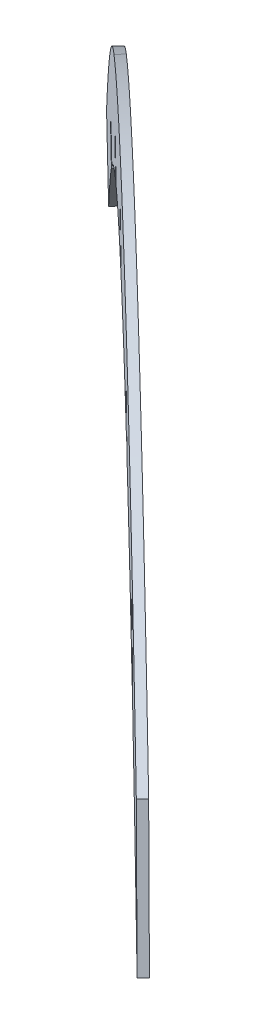
ISO-10303-21;
HEADER;
FILE_DESCRIPTION(('STEP AP214'),'2;1');
FILE_NAME('part.step','',(''),(''),'','','');
FILE_SCHEMA(('AUTOMOTIVE_DESIGN { 1 0 10303 214 1 1 1 1 }'));
ENDSEC;
DATA;
#1=APPLICATION_CONTEXT('core data for automotive mechanical design processes');
#2=APPLICATION_PROTOCOL_DEFINITION('international standard','automotive_design',2000,#1);
#3=PRODUCT_CONTEXT('',#1,'mechanical');
#4=PRODUCT('Part','Part','',(#3));
#5=PRODUCT_RELATED_PRODUCT_CATEGORY('part','',(#4));
#6=PRODUCT_DEFINITION_FORMATION('','',#4);
#7=PRODUCT_DEFINITION_CONTEXT('part definition',#1,'design');
#8=PRODUCT_DEFINITION('design','',#6,#7);
#9=PRODUCT_DEFINITION_SHAPE('','',#8);
#10=(LENGTH_UNIT() NAMED_UNIT(*) SI_UNIT(.MILLI.,.METRE.));
#11=(NAMED_UNIT(*) PLANE_ANGLE_UNIT() SI_UNIT($,.RADIAN.));
#12=(NAMED_UNIT(*) SI_UNIT($,.STERADIAN.) SOLID_ANGLE_UNIT());
#13=UNCERTAINTY_MEASURE_WITH_UNIT(LENGTH_MEASURE(1.E-05),#10,'distance_accuracy_value','');
#14=(GEOMETRIC_REPRESENTATION_CONTEXT(3) GLOBAL_UNCERTAINTY_ASSIGNED_CONTEXT((#13)) GLOBAL_UNIT_ASSIGNED_CONTEXT((#10,
#11,#12)) REPRESENTATION_CONTEXT('',''));
#15=CARTESIAN_POINT('',(0.,0.,0.));
#16=DIRECTION('',(0.,0.,1.));
#17=DIRECTION('',(1.,0.,0.));
#18=AXIS2_PLACEMENT_3D('',#15,#16,#17);
#19=CARTESIAN_POINT('',(-161.990390566707,0.,168.265005002207));
#20=DIRECTION('',(-0.693547097638021,0.,0.720411287639136));
#21=DIRECTION('',(0.720411287639136,0.,0.693547097638021));
#22=AXIS2_PLACEMENT_3D('',#19,#20,#21);
#23=PLANE('',#22);
#24=DIRECTION('',(0.296188126760789,-0.911573321638445,0.285143249688622));
#25=VECTOR('',#24,1.);
#26=CARTESIAN_POINT('',(-24.4915483938894,86.0823395881482,300.636505218503));
#27=LINE('',#26,#25);
#28=CARTESIAN_POINT('',(-82.6518621922966,265.08137988245,244.644993807306));
#29=VERTEX_POINT('',#28);
#30=CARTESIAN_POINT('',(-73.4352720583459,236.715632158299,253.517896616017));
#31=VERTEX_POINT('',#30);
#32=EDGE_CURVE('E45',#29,#31,#27,.T.);
#33=ORIENTED_EDGE('',*,*,#32,.F.);
#34=DIRECTION('',(0.656707710419034,0.411137543015786,0.632219031506591));
#35=VECTOR('',#34,1.);
#36=CARTESIAN_POINT('',(-220.150704365114,178.9990402943,112.27349359101));
#37=LINE('',#36,#35);
#38=CARTESIAN_POINT('',(-86.573484737428,262.626214163729,240.869608855856));
#39=VERTEX_POINT('',#38);
#40=EDGE_CURVE('E49',#39,#29,#37,.T.);
#41=ORIENTED_EDGE('',*,*,#40,.F.);
#42=DIRECTION('',(-0.29618812676079,0.911573321638444,-0.285143249688622));
#43=VECTOR('',#42,1.);
#44=CARTESIAN_POINT('',(-28.4131709390208,83.6271738694272,296.861120267053));
#45=LINE('',#44,#43);
#46=CARTESIAN_POINT('',(-79.5182984080354,240.912583346054,247.661706767148));
#47=VERTEX_POINT('',#46);
#48=EDGE_CURVE('E207',#47,#39,#45,.T.);
#49=ORIENTED_EDGE('',*,*,#48,.F.);
#50=CARTESIAN_POINT('',(-161.990390566707,0.,168.265005002207));
#51=DIRECTION('',(-0.693547097638021,0.,0.720411287639136));
#52=DIRECTION('',(0.720411287639136,0.,0.693547097638021));
#53=AXIS2_PLACEMENT_3D('',#50,#51,#52);
#54=CIRCLE('',#53,266.728991770015);
#55=CARTESIAN_POINT('',(-131.222329554302,263.28747511448,197.885722752248));
#56=VERTEX_POINT('',#55);
#57=EDGE_CURVE('E195',#47,#56,#54,.T.);
#58=ORIENTED_EDGE('',*,*,#57,.T.);
#59=DIRECTION('',(0.415993734480634,-0.816433673516002,0.40048129746846));
#60=VECTOR('',#59,1.);
#61=CARTESIAN_POINT('',(-52.0608449404792,107.924313780009,274.095269771638));
#62=LINE('',#61,#60);
#63=CARTESIAN_POINT('',(-138.551072224337,277.670942470834,190.830269436413));
#64=VERTEX_POINT('',#63);
#65=EDGE_CURVE('E566',#64,#56,#62,.T.);
#66=ORIENTED_EDGE('',*,*,#65,.F.);
#67=DIRECTION('',(0.712306648143752,-0.14957764484681,0.685744680746628));
#68=VECTOR('',#67,1.);
#69=CARTESIAN_POINT('',(-131.88147918897,276.270391148006,197.251152856028));
#70=LINE('',#69,#68);
#71=CARTESIAN_POINT('',(-142.606410056315,278.522524978938,186.926155451016));
#72=VERTEX_POINT('',#71);
#73=EDGE_CURVE('E568',#72,#64,#70,.T.);
#74=ORIENTED_EDGE('',*,*,#73,.F.);
#75=DIRECTION('',(-0.415993734480635,0.816433673516002,-0.400481297468461));
#76=VECTOR('',#75,1.);
#77=CARTESIAN_POINT('',(-54.4747628488222,105.554428302041,271.771367039972));
#78=LINE('',#77,#76);
#79=CARTESIAN_POINT('',(-135.277667386281,264.139057622585,193.981608766851));
#80=VERTEX_POINT('',#79);
#81=EDGE_CURVE('E560',#80,#72,#78,.T.);
#82=ORIENTED_EDGE('',*,*,#81,.F.);
#83=CARTESIAN_POINT('',(-188.398027941033,264.198160795168,142.842110371472));
#84=VERTEX_POINT('',#83);
#85=EDGE_CURVE('E204',#80,#84,#54,.T.);
#86=ORIENTED_EDGE('',*,*,#85,.T.);
#87=DIRECTION('',(0.511561649630661,-0.704104205758039,0.492485478020416));
#88=VECTOR('',#87,1.);
#89=CARTESIAN_POINT('',(-79.9200617798884,114.891049401487,247.274925181037));
#90=LINE('',#89,#88);
#91=CARTESIAN_POINT('',(-200.023773259708,280.199626463793,131.6498899524));
#92=VERTEX_POINT('',#91);
#93=EDGE_CURVE('E585',#92,#84,#90,.T.);
#94=ORIENTED_EDGE('',*,*,#93,.F.);
#95=DIRECTION('',(0.507244617502286,0.710096660627149,0.488329428338218));
#96=VECTOR('',#95,1.);
#97=CARTESIAN_POINT('',(-282.094102046526,165.30857706231,52.6399697735707));
#98=LINE('',#97,#96);
#99=CARTESIAN_POINT('',(-202.437691168051,276.820359367411,129.325987220733));
#100=VERTEX_POINT('',#99);
#101=EDGE_CURVE('E588',#100,#92,#98,.T.);
#102=ORIENTED_EDGE('',*,*,#101,.F.);
#103=DIRECTION('',(-0.511561649630663,0.704104205758037,-0.492485478020417));
#104=VECTOR('',#103,1.);
#105=CARTESIAN_POINT('',(-82.3339796882314,111.511782305105,244.951022449371));
#106=LINE('',#105,#104);
#107=CARTESIAN_POINT('',(-192.626942304918,263.317022005911,138.770892535834));
#108=VERTEX_POINT('',#107);
#109=EDGE_CURVE('E579',#108,#100,#106,.T.);
#110=ORIENTED_EDGE('',*,*,#109,.F.);
#111=CARTESIAN_POINT('',(-239.447626072432,244.098788208333,93.6961555160933));
#112=VERTEX_POINT('',#111);
#113=EDGE_CURVE('E700',#108,#112,#54,.T.);
#114=ORIENTED_EDGE('',*,*,#113,.T.);
#115=DIRECTION('',(0.584524481123479,-0.584524481123469,0.562727520150443));
#116=VECTOR('',#115,1.);
#117=CARTESIAN_POINT('',(-105.054159720959,109.705321856862,223.078079604249));
#118=LINE('',#117,#116);
#119=CARTESIAN_POINT('',(-247.793686502976,252.444848638877,85.6613202940018));
#120=VERTEX_POINT('',#119);
#121=EDGE_CURVE('E637',#120,#112,#118,.T.);
#122=ORIENTED_EDGE('',*,*,#121,.F.);
#123=DIRECTION('',(0.661854354423332,0.394915708988522,0.637173756776727));
#124=VECTOR('',#123,1.);
#125=CARTESIAN_POINT('',(-241.355333622338,256.286489440335,91.8595865212965));
#126=LINE('',#125,#124);
#127=CARTESIAN_POINT('',(-252.21854121218,249.804623303834,81.4014687429585));
#128=VERTEX_POINT('',#127);
#129=EDGE_CURVE('E635',#128,#120,#126,.T.);
#130=ORIENTED_EDGE('',*,*,#129,.F.);
#131=DIRECTION('',(-0.584524481123477,0.584524481123472,-0.562727520150442));
#132=VECTOR('',#131,1.);
#133=CARTESIAN_POINT('',(-107.468077629302,105.054159720958,220.754176872583));
#134=LINE('',#133,#132);
#135=CARTESIAN_POINT('',(-243.7766083841,241.362690475754,89.5286012738176));
#136=VERTEX_POINT('',#135);
#137=EDGE_CURVE('E633',#136,#128,#134,.T.);
#138=ORIENTED_EDGE('',*,*,#137,.F.);
#139=CARTESIAN_POINT('',(-281.200443506205,209.194602388929,53.5003037210707));
#140=VERTEX_POINT('',#139);
#141=EDGE_CURVE('E206',#136,#140,#54,.T.);
#142=ORIENTED_EDGE('',*,*,#141,.T.);
#143=DIRECTION('',(0.638267967472518,-0.463728822431131,0.614466907933322));
#144=VECTOR('',#143,1.);
#145=CARTESIAN_POINT('',(-125.707748434079,96.2225466738744,203.194664736145));
#146=LINE('',#145,#144);
#147=CARTESIAN_POINT('',(-290.705913585487,216.100730647213,44.3492933214767));
#148=VERTEX_POINT('',#147);
#149=EDGE_CURVE('E604',#148,#140,#146,.T.);
#150=ORIENTED_EDGE('',*,*,#149,.F.);
#151=DIRECTION('',(0.334075478196758,0.885977188814799,0.321617778997732));
#152=VECTOR('',#151,1.);
#153=CARTESIAN_POINT('',(-326.988555715077,119.878184023139,9.41963359046363));
#154=LINE('',#153,#152);
#155=CARTESIAN_POINT('',(-293.11983149383,209.698955174175,42.0253905898103));
#156=VERTEX_POINT('',#155);
#157=EDGE_CURVE('E607',#156,#148,#154,.T.);
#158=ORIENTED_EDGE('',*,*,#157,.F.);
#159=DIRECTION('',(-0.63826796741297,0.463728822589054,-0.614466907875995));
#160=VECTOR('',#159,1.);
#161=CARTESIAN_POINT('',(-128.12166634546,89.8207711510343,200.870762001554));
#162=LINE('',#161,#160);
#163=CARTESIAN_POINT('',(-285.589447539816,204.227810979374,49.2749659712872));
#164=VERTEX_POINT('',#163);
#165=EDGE_CURVE('E599',#164,#156,#162,.T.);
#166=ORIENTED_EDGE('',*,*,#165,.F.);
#167=CARTESIAN_POINT('',(-312.87254166876,165.165675002587,23.0092604328248));
#168=VERTEX_POINT('',#167);
#169=EDGE_CURVE('E618',#164,#168,#54,.T.);
#170=ORIENTED_EDGE('',*,*,#169,.T.);
#171=DIRECTION('',(0.67628935294889,-0.344586636549576,0.651070473143593));
#172=VECTOR('',#171,1.);
#173=CARTESIAN_POINT('',(-335.335977722997,176.611367355312,1.38348756431692));
#174=LINE('',#173,#172);
#175=CARTESIAN_POINT('',(-333.521282928556,175.686734174479,3.13051225615327));
#176=VERTEX_POINT('',#175);
#177=EDGE_CURVE('E640',#176,#168,#174,.T.);
#178=ORIENTED_EDGE('',*,*,#177,.F.);
#179=CARTESIAN_POINT('',(-337.076263400116,168.762219099896,-0.291902731666349));
#180=CARTESIAN_POINT('',(-332.060183368177,178.813727079636,4.53712730626155));
#181=CARTESIAN_POINT('',(-326.676500962699,188.365480078971,9.72005179813079));
#182=CARTESIAN_POINT('',(-315.22164244929,206.53433922405,20.7477577934989));
#183=CARTESIAN_POINT('',(-309.150955964705,215.15211101214,26.5920679317423));
#184=CARTESIAN_POINT('',(-299.530478500676,227.379377620367,35.8537970822321));
#185=CARTESIAN_POINT('',(-296.237546670195,231.338072141588,39.0239352421074));
#186=CARTESIAN_POINT('',(-289.47228851309,239.011574584378,45.5369164240221));
#187=CARTESIAN_POINT('',(-286.000214208807,242.726725130017,48.8795168216507));
#188=CARTESIAN_POINT('',(-278.859787579345,249.890186490247,55.7536764159422));
#189=CARTESIAN_POINT('',(-275.2161116445,253.315093679198,59.2614794066848));
#190=CARTESIAN_POINT('',(-269.628302330082,258.173655161568,64.6409189000192));
#191=CARTESIAN_POINT('',(-267.744906528284,259.746699718029,66.4540827335856));
#192=CARTESIAN_POINT('',(-263.929689162367,262.784547330973,70.1270303627952));
#193=CARTESIAN_POINT('',(-261.998106643118,264.249884701716,71.9865840275682));
#194=CARTESIAN_POINT('',(-260.035404079115,265.64566239674,73.8760972683337));
#195=B_SPLINE_CURVE_WITH_KNOTS('',3,(#179,#180,#181,#182,#183,#184,#185,#186,#187,#188,#189,
#190,#191,#192,#193,#194),.UNSPECIFIED.,.F.,.F.,(4,2,2,2,2,2,2,4),(0.,0.25,0.500000000000001,
0.625000000000001,0.75,0.875,0.9375,1.),.UNSPECIFIED.);
#196=CARTESIAN_POINT('',(-260.035404079115,265.64566239674,73.8760972683337));
#197=VERTEX_POINT('',#196);
#198=EDGE_CURVE('E664',#176,#197,#195,.T.);
#199=ORIENTED_EDGE('',*,*,#198,.T.);
#200=CARTESIAN_POINT('',(-161.990390566707,0.,168.265005002207));
#201=DIRECTION('',(-0.693547097638021,0.,0.720411287639136));
#202=DIRECTION('',(0.720411287639136,0.,0.693547097638021));
#203=AXIS2_PLACEMENT_3D('',#200,#201,#202);
#204=CIRCLE('',#203,298.478991770015);
#205=CARTESIAN_POINT('',(-38.7375533129037,244.579285904144,286.921734872666));
#206=VERTEX_POINT('',#205);
#207=EDGE_CURVE('E273',#206,#197,#204,.T.);
#208=ORIENTED_EDGE('',*,*,#207,.F.);
#209=DIRECTION('',(-0.154690063876281,0.976674625104025,-0.148921659995665));
#210=VECTOR('',#209,1.);
#211=CARTESIAN_POINT('',(-7.46883856278804,47.1563907886643,317.024436945648));
#212=LINE('',#211,#210);
#213=CARTESIAN_POINT('',(-30.8850268545113,195.000385083445,294.481440040795));
#214=VERTEX_POINT('',#213);
#215=EDGE_CURVE('E650',#214,#206,#212,.T.);
#216=ORIENTED_EDGE('',*,*,#215,.F.);
#217=EDGE_CURVE('E203',#214,#31,#54,.T.);
#218=ORIENTED_EDGE('',*,*,#217,.T.);
#219=EDGE_LOOP('',(#33,#41,#49,#58,#66,#74,#82,#86,#94,#102,#110,#114,#122,#130,#138,#142,#150,
#158,#166,#170,#178,#199,#208,#216,#218));
#220=FACE_BOUND('',#219,.T.);
#221=ADVANCED_FACE('F30',(#220),#23,.F.);
#222=CARTESIAN_POINT('',(-164.227634794267,0.,170.588907733874));
#223=DIRECTION('',(-0.693547097638021,0.,0.720411287639136));
#224=DIRECTION('',(0.720411287639136,0.,0.693547097638021));
#225=AXIS2_PLACEMENT_3D('',#222,#223,#224);
#226=PLANE('',#225);
#227=DIRECTION('',(0.656707710419034,0.411137543015786,0.632219031506591));
#228=VECTOR('',#227,1.);
#229=CARTESIAN_POINT('',(-222.387948592675,178.9990402943,114.597396322676));
#230=LINE('',#229,#228);
#231=CARTESIAN_POINT('',(-88.8107289649887,262.626214163729,243.193511587522));
#232=VERTEX_POINT('',#231);
#233=CARTESIAN_POINT('',(-84.8891064198574,265.08137988245,246.968896538972));
#234=VERTEX_POINT('',#233);
#235=EDGE_CURVE('E11',#232,#234,#230,.T.);
#236=ORIENTED_EDGE('',*,*,#235,.T.);
#237=DIRECTION('',(0.296188126760789,-0.911573321638445,0.285143249688622));
#238=VECTOR('',#237,1.);
#239=CARTESIAN_POINT('',(-26.7287926214501,86.0823395881482,302.960407950169));
#240=LINE('',#239,#238);
#241=CARTESIAN_POINT('',(-75.6725162859068,236.715632158299,255.841799347684));
#242=VERTEX_POINT('',#241);
#243=EDGE_CURVE('E211',#234,#242,#240,.T.);
#244=ORIENTED_EDGE('',*,*,#243,.T.);
#245=CARTESIAN_POINT('',(-164.227634794267,0.,170.588907733874));
#246=DIRECTION('',(-0.693547097638021,0.,0.720411287639136));
#247=DIRECTION('',(0.720411287639136,0.,0.693547097638021));
#248=AXIS2_PLACEMENT_3D('',#245,#246,#247);
#249=CIRCLE('',#248,266.728991770015);
#250=CARTESIAN_POINT('',(-33.1222710820721,195.000385083445,296.805342772461));
#251=VERTEX_POINT('',#250);
#252=EDGE_CURVE('E620',#251,#242,#249,.T.);
#253=ORIENTED_EDGE('',*,*,#252,.F.);
#254=DIRECTION('',(-0.154690063876281,0.976674625104025,-0.148921659995665));
#255=VECTOR('',#254,1.);
#256=CARTESIAN_POINT('',(-9.70608279034876,47.1563907886643,319.348339677314));
#257=LINE('',#256,#255);
#258=CARTESIAN_POINT('',(-40.9747975404644,244.579285904144,289.245637604332));
#259=VERTEX_POINT('',#258);
#260=EDGE_CURVE('E257',#251,#259,#257,.T.);
#261=ORIENTED_EDGE('',*,*,#260,.T.);
#262=CARTESIAN_POINT('',(-164.227634794267,0.,170.588907733874));
#263=DIRECTION('',(-0.693547097638021,0.,0.720411287639136));
#264=DIRECTION('',(0.720411287639136,0.,0.693547097638021));
#265=AXIS2_PLACEMENT_3D('',#262,#263,#264);
#266=CIRCLE('',#265,298.478991770015);
#267=CARTESIAN_POINT('',(-262.272648306676,265.64566239674,76.2));
#268=VERTEX_POINT('',#267);
#269=EDGE_CURVE('E674',#259,#268,#266,.T.);
#270=ORIENTED_EDGE('',*,*,#269,.T.);
#271=CARTESIAN_POINT('',(-335.758524631688,175.686738955539,5.45441741811242));
#272=CARTESIAN_POINT('',(-331.777573547251,183.226331841843,9.28691854326594));
#273=CARTESIAN_POINT('',(-327.583239529336,190.475830889219,13.3248455365836));
#274=CARTESIAN_POINT('',(-317.458886676851,206.53433922405,23.0716605251652));
#275=CARTESIAN_POINT('',(-311.388200192266,215.15211101214,28.9159706634086));
#276=CARTESIAN_POINT('',(-301.767722728237,227.379377620367,38.1776998138984));
#277=CARTESIAN_POINT('',(-298.474790897756,231.338072141588,41.3478379737737));
#278=CARTESIAN_POINT('',(-291.709532740651,239.011574584378,47.8608191556883));
#279=CARTESIAN_POINT('',(-288.237458436368,242.726725130017,51.203419553317));
#280=CARTESIAN_POINT('',(-281.097031806906,249.890186490247,58.0775791476085));
#281=CARTESIAN_POINT('',(-277.453355872061,253.315093679198,61.5853821383511));
#282=CARTESIAN_POINT('',(-271.865546557642,258.173655161568,66.9648216316855));
#283=CARTESIAN_POINT('',(-269.982150755845,259.746699718029,68.7779854652519));
#284=CARTESIAN_POINT('',(-266.166933389928,262.784547330973,72.4509330944615));
#285=CARTESIAN_POINT('',(-264.235350870679,264.249884701716,74.3104867592345));
#286=CARTESIAN_POINT('',(-262.272648306676,265.64566239674,76.2));
#287=B_SPLINE_CURVE_WITH_KNOTS('',3,(#271,#272,#273,#274,#275,#276,#277,#278,#279,#280,#281,
#282,#283,#284,#285,#286),.UNSPECIFIED.,.F.,.F.,(4,2,2,2,2,2,2,4),(0.0580760408068782,0.25,
0.500000000000001,0.625000000000001,0.75,0.875,0.9375,1.),.UNSPECIFIED.);
#288=CARTESIAN_POINT('',(-335.75851992026,175.686730487533,5.45442195385067));
#289=VERTEX_POINT('',#288);
#290=EDGE_CURVE('E264',#289,#268,#287,.T.);
#291=ORIENTED_EDGE('',*,*,#290,.F.);
#292=DIRECTION('',(0.67628935294889,-0.344586636549576,0.651070473143593));
#293=VECTOR('',#292,1.);
#294=CARTESIAN_POINT('',(-143.653119815422,77.8041401489022,190.39619753308));
#295=LINE('',#294,#293);
#296=CARTESIAN_POINT('',(-315.109785896321,165.165675002587,25.3331631644911));
#297=VERTEX_POINT('',#296);
#298=EDGE_CURVE('E643',#289,#297,#295,.T.);
#299=ORIENTED_EDGE('',*,*,#298,.T.);
#300=CARTESIAN_POINT('',(-287.826691767376,204.227810979374,51.5988687029537));
#301=VERTEX_POINT('',#300);
#302=EDGE_CURVE('E613',#301,#297,#249,.T.);
#303=ORIENTED_EDGE('',*,*,#302,.F.);
#304=DIRECTION('',(-0.63826796741297,0.463728822589054,-0.614466907875995));
#305=VECTOR('',#304,1.);
#306=CARTESIAN_POINT('',(-130.358910573021,89.8207711510344,203.19466473322));
#307=LINE('',#306,#305);
#308=CARTESIAN_POINT('',(-295.357075721391,209.698955174175,44.3492933214767));
#309=VERTEX_POINT('',#308);
#310=EDGE_CURVE('E597',#301,#309,#307,.T.);
#311=ORIENTED_EDGE('',*,*,#310,.T.);
#312=DIRECTION('',(0.334075478196758,0.885977188814799,0.321617778997732));
#313=VECTOR('',#312,1.);
#314=CARTESIAN_POINT('',(-329.225799942638,119.878184023139,11.74353632213));
#315=LINE('',#314,#313);
#316=CARTESIAN_POINT('',(-292.943157813048,216.100730647213,46.673196053143));
#317=VERTEX_POINT('',#316);
#318=EDGE_CURVE('E233',#309,#317,#315,.T.);
#319=ORIENTED_EDGE('',*,*,#318,.T.);
#320=DIRECTION('',(0.638267967472518,-0.463728822431131,0.614466907933322));
#321=VECTOR('',#320,1.);
#322=CARTESIAN_POINT('',(-127.94499266164,96.2225466738745,205.518567467811));
#323=LINE('',#322,#321);
#324=CARTESIAN_POINT('',(-283.437687733766,209.194602388929,55.8242064527373));
#325=VERTEX_POINT('',#324);
#326=EDGE_CURVE('E602',#317,#325,#323,.T.);
#327=ORIENTED_EDGE('',*,*,#326,.T.);
#328=CARTESIAN_POINT('',(-246.013852611661,241.362690475754,91.8525040054839));
#329=VERTEX_POINT('',#328);
#330=EDGE_CURVE('E616',#329,#325,#249,.T.);
#331=ORIENTED_EDGE('',*,*,#330,.F.);
#332=DIRECTION('',(-0.584524481123477,0.584524481123472,-0.562727520150442));
#333=VECTOR('',#332,1.);
#334=CARTESIAN_POINT('',(-109.705321856863,105.054159720958,223.078079604249));
#335=LINE('',#334,#333);
#336=CARTESIAN_POINT('',(-254.455785439741,249.804623303834,83.7253714746248));
#337=VERTEX_POINT('',#336);
#338=EDGE_CURVE('E250',#329,#337,#335,.T.);
#339=ORIENTED_EDGE('',*,*,#338,.T.);
#340=DIRECTION('',(0.661854354423332,0.394915708988522,0.637173756776727));
#341=VECTOR('',#340,1.);
#342=CARTESIAN_POINT('',(-243.592577849899,256.286489440335,94.1834892529628));
#343=LINE('',#342,#341);
#344=CARTESIAN_POINT('',(-250.030930730536,252.444848638877,87.9852230256681));
#345=VERTEX_POINT('',#344);
#346=EDGE_CURVE('E247',#337,#345,#343,.T.);
#347=ORIENTED_EDGE('',*,*,#346,.T.);
#348=DIRECTION('',(0.584524481123479,-0.584524481123469,0.562727520150443));
#349=VECTOR('',#348,1.);
#350=CARTESIAN_POINT('',(-107.291403948519,109.705321856862,225.401982335915));
#351=LINE('',#350,#349);
#352=CARTESIAN_POINT('',(-241.684870299993,244.098788208333,96.0200582477596));
#353=VERTEX_POINT('',#352);
#354=EDGE_CURVE('E244',#345,#353,#351,.T.);
#355=ORIENTED_EDGE('',*,*,#354,.T.);
#356=CARTESIAN_POINT('',(-194.864186532479,263.317022005911,141.094795267501));
#357=VERTEX_POINT('',#356);
#358=EDGE_CURVE('E626',#357,#353,#249,.T.);
#359=ORIENTED_EDGE('',*,*,#358,.F.);
#360=DIRECTION('',(-0.511561649630663,0.704104205758037,-0.492485478020417));
#361=VECTOR('',#360,1.);
#362=CARTESIAN_POINT('',(-84.5712239157921,111.511782305105,247.274925181037));
#363=LINE('',#362,#361);
#364=CARTESIAN_POINT('',(-204.674935395611,276.820359367411,131.6498899524));
#365=VERTEX_POINT('',#364);
#366=EDGE_CURVE('E577',#357,#365,#363,.T.);
#367=ORIENTED_EDGE('',*,*,#366,.T.);
#368=DIRECTION('',(0.507244617502286,0.710096660627149,0.488329428338218));
#369=VECTOR('',#368,1.);
#370=CARTESIAN_POINT('',(-284.331346274086,165.30857706231,54.963872505237));
#371=LINE('',#370,#369);
#372=CARTESIAN_POINT('',(-202.261017487268,280.199626463793,133.973792684066));
#373=VERTEX_POINT('',#372);
#374=EDGE_CURVE('E225',#365,#373,#371,.T.);
#375=ORIENTED_EDGE('',*,*,#374,.T.);
#376=DIRECTION('',(0.511561649630661,-0.704104205758039,0.492485478020416));
#377=VECTOR('',#376,1.);
#378=CARTESIAN_POINT('',(-82.1573060074491,114.891049401486,249.598827912703));
#379=LINE('',#378,#377);
#380=CARTESIAN_POINT('',(-190.635272168594,264.198160795168,145.166013103139));
#381=VERTEX_POINT('',#380);
#382=EDGE_CURVE('E582',#373,#381,#379,.T.);
#383=ORIENTED_EDGE('',*,*,#382,.T.);
#384=CARTESIAN_POINT('',(-137.514911613842,264.139057622585,196.305511498517));
#385=VERTEX_POINT('',#384);
#386=EDGE_CURVE('E702',#385,#381,#249,.T.);
#387=ORIENTED_EDGE('',*,*,#386,.F.);
#388=DIRECTION('',(-0.415993734480635,0.816433673516002,-0.400481297468461));
#389=VECTOR('',#388,1.);
#390=CARTESIAN_POINT('',(-56.712007076383,105.554428302041,274.095269771638));
#391=LINE('',#390,#389);
#392=CARTESIAN_POINT('',(-144.843654283876,278.522524978938,189.250058182682));
#393=VERTEX_POINT('',#392);
#394=EDGE_CURVE('E558',#385,#393,#391,.T.);
#395=ORIENTED_EDGE('',*,*,#394,.T.);
#396=DIRECTION('',(0.712306648143752,-0.14957764484681,0.685744680746628));
#397=VECTOR('',#396,1.);
#398=CARTESIAN_POINT('',(-134.118723416531,276.270391148006,199.575055587694));
#399=LINE('',#398,#397);
#400=CARTESIAN_POINT('',(-140.788316451898,277.670942470834,193.15417216808));
#401=VERTEX_POINT('',#400);
#402=EDGE_CURVE('E216',#393,#401,#399,.T.);
#403=ORIENTED_EDGE('',*,*,#402,.T.);
#404=DIRECTION('',(0.415993734480634,-0.816433673516002,0.40048129746846));
#405=VECTOR('',#404,1.);
#406=CARTESIAN_POINT('',(-54.2980891680399,107.924313780009,276.419172503305));
#407=LINE('',#406,#405);
#408=CARTESIAN_POINT('',(-133.459573781863,263.28747511448,200.209625483915));
#409=VERTEX_POINT('',#408);
#410=EDGE_CURVE('E563',#401,#409,#407,.T.);
#411=ORIENTED_EDGE('',*,*,#410,.T.);
#412=CARTESIAN_POINT('',(-81.7555426355963,240.912583346054,249.985609498815));
#413=VERTEX_POINT('',#412);
#414=EDGE_CURVE('E619',#413,#409,#249,.T.);
#415=ORIENTED_EDGE('',*,*,#414,.F.);
#416=DIRECTION('',(-0.29618812676079,0.911573321638444,-0.285143249688622));
#417=VECTOR('',#416,1.);
#418=CARTESIAN_POINT('',(-30.6504151665815,83.6271738694272,299.185022998719));
#419=LINE('',#418,#417);
#420=EDGE_CURVE('E212',#413,#232,#419,.T.);
#421=ORIENTED_EDGE('',*,*,#420,.T.);
#422=EDGE_LOOP('',(#236,#244,#253,#261,#270,#291,#299,#303,#311,#319,#327,#331,#339,#347,#355,
#359,#367,#375,#383,#387,#395,#403,#411,#415,#421));
#423=FACE_BOUND('',#422,.T.);
#424=ADVANCED_FACE('F277',(#423),#226,.T.);
#425=CARTESIAN_POINT('',(-555.793992130632,0.,577.322386463079));
#426=DIRECTION('',(0.693547097638021,0.,-0.720411287639136));
#427=DIRECTION('',(-0.720411287639136,0.,-0.693547097638021));
#428=AXIS2_PLACEMENT_3D('',#425,#426,#427);
#429=CYLINDRICAL_SURFACE('',#428,266.728991770015);
#430=DIRECTION('',(0.693547097638021,0.,-0.720411287639136));
#431=VECTOR('',#430,1.);
#432=CARTESIAN_POINT('',(-467.238873622271,236.715632158299,662.575278076889));
#433=LINE('',#432,#431);
#434=EDGE_CURVE('E38',#31,#242,#433,.F.);
#435=ORIENTED_EDGE('',*,*,#434,.F.);
#436=ORIENTED_EDGE('',*,*,#217,.F.);
#437=DIRECTION('',(0.693547097638021,0.,-0.720411287639136));
#438=VECTOR('',#437,1.);
#439=CARTESIAN_POINT('',(-424.688628418436,195.000385083445,703.538821501667));
#440=LINE('',#439,#438);
#441=EDGE_CURVE('E611',#251,#214,#440,.T.);
#442=ORIENTED_EDGE('',*,*,#441,.F.);
#443=ORIENTED_EDGE('',*,*,#252,.T.);
#444=EDGE_LOOP('',(#435,#436,#442,#443));
#445=FACE_BOUND('',#444,.T.);
#446=ADVANCED_FACE('F286',(#445),#429,.F.);
#447=DIRECTION('',(0.693547097638021,0.,-0.720411287639136));
#448=VECTOR('',#447,1.);
#449=CARTESIAN_POINT('',(-473.32189997196,240.912583346054,656.71908822802));
#450=LINE('',#449,#448);
#451=EDGE_CURVE('E198',#413,#47,#450,.T.);
#452=ORIENTED_EDGE('',*,*,#451,.F.);
#453=ORIENTED_EDGE('',*,*,#414,.T.);
#454=DIRECTION('',(0.693547097638021,0.,-0.720411287639136));
#455=VECTOR('',#454,1.);
#456=CARTESIAN_POINT('',(-525.025931118227,263.28747511448,606.94310421312));
#457=LINE('',#456,#455);
#458=EDGE_CURVE('E201',#56,#409,#457,.F.);
#459=ORIENTED_EDGE('',*,*,#458,.F.);
#460=ORIENTED_EDGE('',*,*,#57,.F.);
#461=EDGE_LOOP('',(#452,#453,#459,#460));
#462=FACE_BOUND('',#461,.T.);
#463=ADVANCED_FACE('F196',(#462),#429,.F.);
#464=DIRECTION('',(0.693547097638021,0.,-0.720411287639136));
#465=VECTOR('',#464,1.);
#466=CARTESIAN_POINT('',(-529.081268950206,264.139057622585,603.038990227723));
#467=LINE('',#466,#465);
#468=EDGE_CURVE('E222',#385,#80,#467,.T.);
#469=ORIENTED_EDGE('',*,*,#468,.F.);
#470=ORIENTED_EDGE('',*,*,#386,.T.);
#471=DIRECTION('',(0.693547097638021,0.,-0.720411287639136));
#472=VECTOR('',#471,1.);
#473=CARTESIAN_POINT('',(-582.201629504958,264.198160795168,551.899491832344));
#474=LINE('',#473,#472);
#475=EDGE_CURVE('E227',#84,#381,#474,.F.);
#476=ORIENTED_EDGE('',*,*,#475,.F.);
#477=ORIENTED_EDGE('',*,*,#85,.F.);
#478=EDGE_LOOP('',(#469,#470,#476,#477));
#479=FACE_BOUND('',#478,.T.);
#480=ADVANCED_FACE('F313',(#479),#429,.F.);
#481=DIRECTION('',(0.693547097638021,0.,-0.720411287639136));
#482=VECTOR('',#481,1.);
#483=CARTESIAN_POINT('',(-586.430543868843,263.317022005911,547.828273996706));
#484=LINE('',#483,#482);
#485=EDGE_CURVE('E230',#357,#108,#484,.T.);
#486=ORIENTED_EDGE('',*,*,#485,.F.);
#487=ORIENTED_EDGE('',*,*,#358,.T.);
#488=DIRECTION('',(0.693547097638021,0.,-0.720411287639136));
#489=VECTOR('',#488,1.);
#490=CARTESIAN_POINT('',(-633.251227636357,244.098788208333,502.753536976965));
#491=LINE('',#490,#489);
#492=EDGE_CURVE('E623',#353,#112,#491,.T.);
#493=ORIENTED_EDGE('',*,*,#492,.T.);
#494=ORIENTED_EDGE('',*,*,#113,.F.);
#495=EDGE_LOOP('',(#486,#487,#493,#494));
#496=FACE_BOUND('',#495,.T.);
#497=ADVANCED_FACE('F320',(#496),#429,.F.);
#498=DIRECTION('',(0.693547097638021,0.,-0.720411287639136));
#499=VECTOR('',#498,1.);
#500=CARTESIAN_POINT('',(-675.004045070131,209.194602388929,462.557685181943));
#501=LINE('',#500,#499);
#502=EDGE_CURVE('E235',#140,#325,#501,.F.);
#503=ORIENTED_EDGE('',*,*,#502,.F.);
#504=ORIENTED_EDGE('',*,*,#141,.F.);
#505=DIRECTION('',(0.693547097638021,0.,-0.720411287639136));
#506=VECTOR('',#505,1.);
#507=CARTESIAN_POINT('',(-637.580209948025,241.362690475754,498.58598273469));
#508=LINE('',#507,#506);
#509=EDGE_CURVE('E241',#136,#329,#508,.F.);
#510=ORIENTED_EDGE('',*,*,#509,.T.);
#511=ORIENTED_EDGE('',*,*,#330,.T.);
#512=EDGE_LOOP('',(#503,#504,#510,#511));
#513=FACE_BOUND('',#512,.T.);
#514=ADVANCED_FACE('F329',(#513),#429,.F.);
#515=DIRECTION('',(0.693547097638021,0.,-0.720411287639136));
#516=VECTOR('',#515,1.);
#517=CARTESIAN_POINT('',(-679.393049103741,204.227810979374,458.332347432159));
#518=LINE('',#517,#516);
#519=EDGE_CURVE('E238',#301,#164,#518,.T.);
#520=ORIENTED_EDGE('',*,*,#519,.F.);
#521=ORIENTED_EDGE('',*,*,#302,.T.);
#522=DIRECTION('',(0.693547097638021,0.,-0.720411287639136));
#523=VECTOR('',#522,1.);
#524=CARTESIAN_POINT('',(-706.676143232695,165.165675002569,432.066641893687));
#525=LINE('',#524,#523);
#526=EDGE_CURVE('E610',#297,#168,#525,.T.);
#527=ORIENTED_EDGE('',*,*,#526,.T.);
#528=ORIENTED_EDGE('',*,*,#169,.F.);
#529=EDGE_LOOP('',(#520,#521,#527,#528));
#530=FACE_BOUND('',#529,.T.);
#531=ADVANCED_FACE('F307',(#530),#429,.F.);
#532=CARTESIAN_POINT('',(-155.657442862485,168.762219099896,-188.737887943909));
#533=CARTESIAN_POINT('',(-150.641362830545,178.813727079636,-183.908857905981));
#534=CARTESIAN_POINT('',(-145.257680425068,188.365480078971,-178.725933414112));
#535=CARTESIAN_POINT('',(-133.802821911659,206.53433922405,-167.698227418744));
#536=CARTESIAN_POINT('',(-127.732135427074,215.15211101214,-161.853917280501));
#537=CARTESIAN_POINT('',(-118.111657963045,227.379377620367,-152.592188130011));
#538=CARTESIAN_POINT('',(-114.818726132564,231.338072141588,-149.422049970136));
#539=CARTESIAN_POINT('',(-108.053467975458,239.011574584378,-142.909068788221));
#540=CARTESIAN_POINT('',(-104.581393671176,242.726725130017,-139.566468390592));
#541=CARTESIAN_POINT('',(-97.4409670417138,249.890186490247,-132.692308796301));
#542=CARTESIAN_POINT('',(-93.7972911068689,253.315093679198,-129.184505805558));
#543=CARTESIAN_POINT('',(-88.2094817924501,258.173655161568,-123.805066312224));
#544=CARTESIAN_POINT('',(-86.3260859906525,259.746699718029,-121.991902478657));
#545=CARTESIAN_POINT('',(-82.5108686247353,262.784547330973,-118.318954849448));
#546=CARTESIAN_POINT('',(-80.5792861054868,264.249884701716,-116.459401184675));
#547=CARTESIAN_POINT('',(-78.6165835414837,265.64566239674,-114.569887943909));
#548=B_SPLINE_CURVE_WITH_KNOTS('',3,(#532,#533,#534,#535,#536,#537,#538,#539,#540,#541,#542,
#543,#544,#545,#546,#547),.UNSPECIFIED.,.F.,.F.,(4,2,2,2,2,2,2,4),(0.,0.25,0.500000000000001,
0.625000000000001,0.75,0.875,0.9375,1.),.UNSPECIFIED.);
#549=DIRECTION('',(-0.693547097638021,0.,0.720411287639136));
#550=VECTOR('',#549,1.);
#551=SURFACE_OF_LINEAR_EXTRUSION('',#548,#550);
#552=DIRECTION('',(-0.693547097638021,0.,0.720411287639136));
#553=VECTOR('',#552,1.);
#554=CARTESIAN_POINT('',(-334.639905042336,175.686734174479,4.29246362198647));
#555=LINE('',#554,#553);
#556=EDGE_CURVE('E252',#289,#176,#555,.F.);
#557=ORIENTED_EDGE('',*,*,#556,.F.);
#558=ORIENTED_EDGE('',*,*,#290,.T.);
#559=DIRECTION('',(-0.693547097638021,0.,0.720411287639136));
#560=VECTOR('',#559,1.);
#561=CARTESIAN_POINT('',(-78.6165835414837,265.64566239674,-114.569887943909));
#562=LINE('',#561,#560);
#563=EDGE_CURVE('E651',#197,#268,#562,.T.);
#564=ORIENTED_EDGE('',*,*,#563,.F.);
#565=ORIENTED_EDGE('',*,*,#198,.F.);
#566=EDGE_LOOP('',(#557,#558,#564,#565));
#567=FACE_BOUND('',#566,.T.);
#568=ADVANCED_FACE('F287',(#567),#551,.F.);
#569=CARTESIAN_POINT('',(-161.990390566707,0.,168.265005002207));
#570=DIRECTION('',(-0.693547097638021,0.,0.720411287639136));
#571=DIRECTION('',(0.720411287639136,0.,0.693547097638021));
#572=AXIS2_PLACEMENT_3D('',#569,#570,#571);
#573=CYLINDRICAL_SURFACE('',#572,298.478991770015);
#574=ORIENTED_EDGE('',*,*,#269,.F.);
#575=DIRECTION('',(0.693547097638021,0.,-0.720411287639136));
#576=VECTOR('',#575,1.);
#577=CARTESIAN_POINT('',(-530.775799715592,244.579285904144,798.018829598985));
#578=LINE('',#577,#576);
#579=EDGE_CURVE('E645',#259,#206,#578,.T.);
#580=ORIENTED_EDGE('',*,*,#579,.T.);
#581=ORIENTED_EDGE('',*,*,#207,.T.);
#582=ORIENTED_EDGE('',*,*,#563,.T.);
#583=EDGE_LOOP('',(#574,#580,#581,#582));
#584=FACE_BOUND('',#583,.T.);
#585=ADVANCED_FACE('F32',(#584),#573,.T.);
#586=CARTESIAN_POINT('',(-530.775799715592,244.579285904144,798.018829598985));
#587=DIRECTION('',(0.703607424275661,0.214724653167521,0.677369851577598));
#588=DIRECTION('',(0.69354709763802,0.,-0.720411287639136));
#589=AXIS2_PLACEMENT_3D('',#586,#587,#588);
#590=PLANE('',#589);
#591=ORIENTED_EDGE('',*,*,#441,.T.);
#592=ORIENTED_EDGE('',*,*,#215,.T.);
#593=ORIENTED_EDGE('',*,*,#579,.F.);
#594=ORIENTED_EDGE('',*,*,#260,.F.);
#595=EDGE_LOOP('',(#591,#592,#593,#594));
#596=FACE_BOUND('',#595,.T.);
#597=ADVANCED_FACE('F359',(#596),#590,.T.);
#598=CARTESIAN_POINT('',(-335.335977722997,176.611367355312,1.38348756431692));
#599=DIRECTION('',(-0.248244102539919,-0.9387545205811,-0.238987061663806));
#600=DIRECTION('',(0.966768820729016,-0.255652199807135,0.));
#601=AXIS2_PLACEMENT_3D('',#598,#599,#600);
#602=PLANE('',#601);
#603=ORIENTED_EDGE('',*,*,#526,.F.);
#604=ORIENTED_EDGE('',*,*,#298,.F.);
#605=ORIENTED_EDGE('',*,*,#556,.T.);
#606=ORIENTED_EDGE('',*,*,#177,.T.);
#607=EDGE_LOOP('',(#603,#604,#605,#606));
#608=FACE_BOUND('',#607,.T.);
#609=ADVANCED_FACE('F366',(#608),#602,.T.);
#610=CARTESIAN_POINT('',(-641.597288066901,252.444848638877,494.718701754874));
#611=DIRECTION('',(-0.421098034102756,-0.811376072464144,-0.405395257381552));
#612=DIRECTION('',(0.887582579804661,-0.46064863402305,0.));
#613=AXIS2_PLACEMENT_3D('',#610,#611,#612);
#614=PLANE('',#613);
#615=ORIENTED_EDGE('',*,*,#492,.F.);
#616=ORIENTED_EDGE('',*,*,#354,.F.);
#617=DIRECTION('',(0.693547097638021,0.,-0.720411287639136));
#618=VECTOR('',#617,1.);
#619=CARTESIAN_POINT('',(-641.597288066901,252.444848638877,494.718701754874));
#620=LINE('',#619,#618);
#621=EDGE_CURVE('E630',#345,#120,#620,.T.);
#622=ORIENTED_EDGE('',*,*,#621,.T.);
#623=ORIENTED_EDGE('',*,*,#121,.T.);
#624=EDGE_LOOP('',(#615,#616,#622,#623));
#625=FACE_BOUND('',#624,.T.);
#626=ADVANCED_FACE('F373',(#625),#614,.T.);
#627=CARTESIAN_POINT('',(-646.022142776105,249.804623303834,490.45885020383));
#628=DIRECTION('',(0.284501734421344,-0.918717357403294,0.273892643780651));
#629=DIRECTION('',(0.955245693447456,0.295813564851394,0.));
#630=AXIS2_PLACEMENT_3D('',#627,#628,#629);
#631=PLANE('',#630);
#632=DIRECTION('',(0.693547097638021,0.,-0.720411287639136));
#633=VECTOR('',#632,1.);
#634=CARTESIAN_POINT('',(-646.022142776105,249.804623303834,490.45885020383));
#635=LINE('',#634,#633);
#636=EDGE_CURVE('E627',#337,#128,#635,.T.);
#637=ORIENTED_EDGE('',*,*,#636,.T.);
#638=ORIENTED_EDGE('',*,*,#129,.T.);
#639=ORIENTED_EDGE('',*,*,#621,.F.);
#640=ORIENTED_EDGE('',*,*,#346,.F.);
#641=EDGE_LOOP('',(#637,#638,#639,#640));
#642=FACE_BOUND('',#641,.T.);
#643=ADVANCED_FACE('F381',(#642),#631,.T.);
#644=CARTESIAN_POINT('',(-646.022142776105,249.804623303834,490.45885020383));
#645=DIRECTION('',(0.421098034102758,0.811376072464142,0.405395257381554));
#646=DIRECTION('',(-0.88758257980466,0.460648634023053,0.));
#647=AXIS2_PLACEMENT_3D('',#644,#645,#646);
#648=PLANE('',#647);
#649=ORIENTED_EDGE('',*,*,#509,.F.);
#650=ORIENTED_EDGE('',*,*,#137,.T.);
#651=ORIENTED_EDGE('',*,*,#636,.F.);
#652=ORIENTED_EDGE('',*,*,#338,.F.);
#653=EDGE_LOOP('',(#649,#650,#651,#652));
#654=FACE_BOUND('',#653,.T.);
#655=ADVANCED_FACE('F388',(#654),#648,.T.);
#656=CARTESIAN_POINT('',(-680.497655049725,216.100730647213,449.239417345778));
#657=DIRECTION('',(0.638267967412971,-0.463728822589049,0.614466907875996));
#658=DIRECTION('',(0.693547097638021,0.,-0.720411287639136));
#659=AXIS2_PLACEMENT_3D('',#656,#657,#658);
#660=PLANE('',#659);
#661=DIRECTION('',(0.693547097638021,0.,-0.720411287639136));
#662=VECTOR('',#661,1.);
#663=CARTESIAN_POINT('',(-682.911572958068,209.698955174175,446.915514614112));
#664=LINE('',#663,#662);
#665=EDGE_CURVE('E591',#309,#156,#664,.T.);
#666=ORIENTED_EDGE('',*,*,#665,.T.);
#667=ORIENTED_EDGE('',*,*,#157,.T.);
#668=DIRECTION('',(0.693547097638021,0.,-0.720411287639136));
#669=VECTOR('',#668,1.);
#670=CARTESIAN_POINT('',(-680.497655049725,216.100730647213,449.239417345778));
#671=LINE('',#670,#669);
#672=EDGE_CURVE('E594',#317,#148,#671,.T.);
#673=ORIENTED_EDGE('',*,*,#672,.F.);
#674=ORIENTED_EDGE('',*,*,#318,.F.);
#675=EDGE_LOOP('',(#666,#667,#673,#674));
#676=FACE_BOUND('',#675,.T.);
#677=ADVANCED_FACE('F395',(#676),#660,.T.);
#678=CARTESIAN_POINT('',(-670.992184970443,209.194602388929,458.390427745373));
#679=DIRECTION('',(-0.334075478082991,-0.885977188897455,-0.321617778888208));
#680=DIRECTION('',(0.935690834557181,-0.352821005788608,0.));
#681=AXIS2_PLACEMENT_3D('',#678,#679,#680);
#682=PLANE('',#681);
#683=ORIENTED_EDGE('',*,*,#672,.T.);
#684=ORIENTED_EDGE('',*,*,#149,.T.);
#685=ORIENTED_EDGE('',*,*,#502,.T.);
#686=ORIENTED_EDGE('',*,*,#326,.F.);
#687=EDGE_LOOP('',(#683,#684,#685,#686));
#688=FACE_BOUND('',#687,.T.);
#689=ADVANCED_FACE('F402',(#688),#682,.T.);
#690=CARTESIAN_POINT('',(-682.911572958068,209.698955174175,446.915514614112));
#691=DIRECTION('',(0.334075478196761,0.885977188814796,0.321617778997735));
#692=DIRECTION('',(-0.935690834506648,0.352821005922624,0.));
#693=AXIS2_PLACEMENT_3D('',#690,#691,#692);
#694=PLANE('',#693);
#695=ORIENTED_EDGE('',*,*,#519,.T.);
#696=ORIENTED_EDGE('',*,*,#165,.T.);
#697=ORIENTED_EDGE('',*,*,#665,.F.);
#698=ORIENTED_EDGE('',*,*,#310,.F.);
#699=EDGE_LOOP('',(#695,#696,#697,#698));
#700=FACE_BOUND('',#699,.T.);
#701=ADVANCED_FACE('F410',(#700),#694,.T.);
#702=CARTESIAN_POINT('',(-592.229432632289,276.820359367411,534.216111245035));
#703=DIRECTION('',(0.511561649630655,-0.704104205758048,0.49248547802041));
#704=DIRECTION('',(0.809016994374949,0.58778525229247,0.));
#705=AXIS2_PLACEMENT_3D('',#702,#703,#704);
#706=PLANE('',#705);
#707=DIRECTION('',(0.693547097638021,0.,-0.720411287639136));
#708=VECTOR('',#707,1.);
#709=CARTESIAN_POINT('',(-592.229432632289,276.820359367411,534.216111245035));
#710=LINE('',#709,#708);
#711=EDGE_CURVE('E571',#365,#100,#710,.T.);
#712=ORIENTED_EDGE('',*,*,#711,.T.);
#713=ORIENTED_EDGE('',*,*,#101,.T.);
#714=DIRECTION('',(0.693547097638021,0.,-0.720411287639136));
#715=VECTOR('',#714,1.);
#716=CARTESIAN_POINT('',(-589.815514723945,280.199626463793,536.540013976702));
#717=LINE('',#716,#715);
#718=EDGE_CURVE('E574',#373,#92,#717,.T.);
#719=ORIENTED_EDGE('',*,*,#718,.F.);
#720=ORIENTED_EDGE('',*,*,#374,.F.);
#721=EDGE_LOOP('',(#712,#713,#719,#720));
#722=FACE_BOUND('',#721,.T.);
#723=ADVANCED_FACE('F417',(#722),#706,.T.);
#724=CARTESIAN_POINT('',(-589.815514723945,280.199626463793,536.540013976702));
#725=DIRECTION('',(-0.50724461750228,-0.710096660627158,-0.488329428338212));
#726=DIRECTION('',(0.813715738499674,-0.581263018708339,0.));
#727=AXIS2_PLACEMENT_3D('',#724,#725,#726);
#728=PLANE('',#727);
#729=ORIENTED_EDGE('',*,*,#718,.T.);
#730=ORIENTED_EDGE('',*,*,#93,.T.);
#731=ORIENTED_EDGE('',*,*,#475,.T.);
#732=ORIENTED_EDGE('',*,*,#382,.F.);
#733=EDGE_LOOP('',(#729,#730,#731,#732));
#734=FACE_BOUND('',#733,.T.);
#735=ADVANCED_FACE('F424',(#734),#728,.T.);
#736=CARTESIAN_POINT('',(-592.229432632289,276.820359367411,534.216111245035));
#737=DIRECTION('',(0.507244617502279,0.71009666062716,0.48832942833821));
#738=DIRECTION('',(-0.813715738499676,0.581263018708336,0.));
#739=AXIS2_PLACEMENT_3D('',#736,#737,#738);
#740=PLANE('',#739);
#741=ORIENTED_EDGE('',*,*,#485,.T.);
#742=ORIENTED_EDGE('',*,*,#109,.T.);
#743=ORIENTED_EDGE('',*,*,#711,.F.);
#744=ORIENTED_EDGE('',*,*,#366,.F.);
#745=EDGE_LOOP('',(#741,#742,#743,#744));
#746=FACE_BOUND('',#745,.T.);
#747=ADVANCED_FACE('F432',(#746),#740,.T.);
#748=CARTESIAN_POINT('',(-528.342813688575,277.670942470834,595.720393460716));
#749=DIRECTION('',(-0.10775742372612,-0.988749982635692,-0.103739141455036));
#750=DIRECTION('',(0.994113683479465,-0.108341978562745,0.));
#751=AXIS2_PLACEMENT_3D('',#748,#749,#750);
#752=PLANE('',#751);
#753=DIRECTION('',(0.693547097638021,0.,-0.720411287639136));
#754=VECTOR('',#753,1.);
#755=CARTESIAN_POINT('',(-532.398151520553,278.522524978938,591.816279475318));
#756=LINE('',#755,#754);
#757=EDGE_CURVE('E552',#393,#72,#756,.T.);
#758=ORIENTED_EDGE('',*,*,#757,.T.);
#759=ORIENTED_EDGE('',*,*,#73,.T.);
#760=DIRECTION('',(0.693547097638021,0.,-0.720411287639136));
#761=VECTOR('',#760,1.);
#762=CARTESIAN_POINT('',(-528.342813688575,277.670942470834,595.720393460716));
#763=LINE('',#762,#761);
#764=EDGE_CURVE('E555',#401,#64,#763,.T.);
#765=ORIENTED_EDGE('',*,*,#764,.F.);
#766=ORIENTED_EDGE('',*,*,#402,.F.);
#767=EDGE_LOOP('',(#758,#759,#765,#766));
#768=FACE_BOUND('',#767,.T.);
#769=ADVANCED_FACE('F439',(#768),#752,.T.);
#770=CARTESIAN_POINT('',(-521.01407101854,263.28747511448,602.77584677655));
#771=DIRECTION('',(-0.588168034009613,-0.577439223424566,-0.566235204680971));
#772=DIRECTION('',(0.700568553486185,-0.713585104851744,0.));
#773=AXIS2_PLACEMENT_3D('',#770,#771,#772);
#774=PLANE('',#773);
#775=ORIENTED_EDGE('',*,*,#764,.T.);
#776=ORIENTED_EDGE('',*,*,#65,.T.);
#777=ORIENTED_EDGE('',*,*,#458,.T.);
#778=ORIENTED_EDGE('',*,*,#410,.F.);
#779=EDGE_LOOP('',(#775,#776,#777,#778));
#780=FACE_BOUND('',#779,.T.);
#781=ADVANCED_FACE('F446',(#780),#774,.T.);
#782=CARTESIAN_POINT('',(-532.398151520553,278.522524978938,591.816279475318));
#783=DIRECTION('',(0.588168034009613,0.577439223424567,0.56623520468097));
#784=DIRECTION('',(-0.700568553486186,0.713585104851743,0.));
#785=AXIS2_PLACEMENT_3D('',#782,#783,#784);
#786=PLANE('',#785);
#787=ORIENTED_EDGE('',*,*,#468,.T.);
#788=ORIENTED_EDGE('',*,*,#81,.T.);
#789=ORIENTED_EDGE('',*,*,#757,.F.);
#790=ORIENTED_EDGE('',*,*,#394,.F.);
#791=EDGE_LOOP('',(#787,#788,#789,#790));
#792=FACE_BOUND('',#791,.T.);
#793=ADVANCED_FACE('F454',(#792),#786,.T.);
#794=CARTESIAN_POINT('',(-472.443603656534,265.08137988245,649.535117831608));
#795=DIRECTION('',(0.296188126760793,-0.911573321638442,0.285143249688626));
#796=DIRECTION('',(0.951056516295151,0.309016994374956,0.));
#797=AXIS2_PLACEMENT_3D('',#794,#795,#796);
#798=PLANE('',#797);
#799=DIRECTION('',(0.693547097638021,0.,-0.720411287639136));
#800=VECTOR('',#799,1.);
#801=CARTESIAN_POINT('',(-476.365226201666,262.626214163729,645.759732880157));
#802=LINE('',#801,#800);
#803=EDGE_CURVE('E544',#232,#39,#802,.T.);
#804=ORIENTED_EDGE('',*,*,#803,.T.);
#805=ORIENTED_EDGE('',*,*,#40,.T.);
#806=DIRECTION('',(0.693547097638021,0.,-0.720411287639136));
#807=VECTOR('',#806,1.);
#808=CARTESIAN_POINT('',(-472.443603656534,265.08137988245,649.535117831608));
#809=LINE('',#808,#807);
#810=EDGE_CURVE('E542',#234,#29,#809,.T.);
#811=ORIENTED_EDGE('',*,*,#810,.F.);
#812=ORIENTED_EDGE('',*,*,#235,.F.);
#813=EDGE_LOOP('',(#804,#805,#811,#812));
#814=FACE_BOUND('',#813,.T.);
#815=ADVANCED_FACE('F461',(#814),#798,.T.);
#816=CARTESIAN_POINT('',(-463.227013522584,236.715632158298,658.408020640319));
#817=DIRECTION('',(-0.656707710419036,-0.411137543015781,-0.632219031506593));
#818=DIRECTION('',(-0.693547097638021,0.,0.720411287639136));
#819=AXIS2_PLACEMENT_3D('',#816,#817,#818);
#820=PLANE('',#819);
#821=ORIENTED_EDGE('',*,*,#810,.T.);
#822=ORIENTED_EDGE('',*,*,#32,.T.);
#823=ORIENTED_EDGE('',*,*,#434,.T.);
#824=ORIENTED_EDGE('',*,*,#243,.F.);
#825=EDGE_LOOP('',(#821,#822,#823,#824));
#826=FACE_BOUND('',#825,.T.);
#827=ADVANCED_FACE('F468',(#826),#820,.T.);
#828=CARTESIAN_POINT('',(-476.365226201666,262.626214163729,645.759732880157));
#829=DIRECTION('',(0.656707710419036,0.411137543015781,0.632219031506593));
#830=DIRECTION('',(0.69354709763802,0.,-0.720411287639136));
#831=AXIS2_PLACEMENT_3D('',#828,#829,#830);
#832=PLANE('',#831);
#833=ORIENTED_EDGE('',*,*,#451,.T.);
#834=ORIENTED_EDGE('',*,*,#48,.T.);
#835=ORIENTED_EDGE('',*,*,#803,.F.);
#836=ORIENTED_EDGE('',*,*,#420,.F.);
#837=EDGE_LOOP('',(#833,#834,#835,#836));
#838=FACE_BOUND('',#837,.T.);
#839=ADVANCED_FACE('F215',(#838),#832,.T.);
#840=CLOSED_SHELL('',(#221,#424,#446,#463,#480,#497,#514,#531,#568,#585,#597,#609,#626,#643,
#655,#677,#689,#701,#723,#735,#747,#769,#781,#793,#815,#827,#839));
#841=MANIFOLD_SOLID_BREP('B2',#840);
#842=ADVANCED_BREP_SHAPE_REPRESENTATION('',(#18,#841),#14);
#843=SHAPE_DEFINITION_REPRESENTATION(#9,#842);
ENDSEC;
END-ISO-10303-21;
